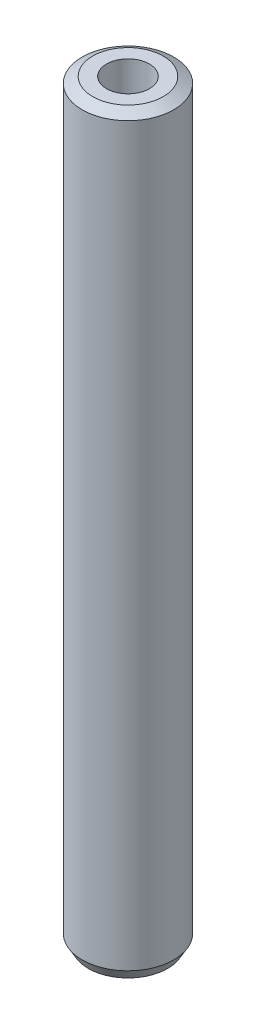
ISO-10303-21;
HEADER;
FILE_DESCRIPTION(('STEP AP214'),'2;1');
FILE_NAME('part.step','',(''),(''),'','','');
FILE_SCHEMA(('AUTOMOTIVE_DESIGN { 1 0 10303 214 1 1 1 1 }'));
ENDSEC;
DATA;
#1=APPLICATION_CONTEXT('core data for automotive mechanical design processes');
#2=APPLICATION_PROTOCOL_DEFINITION('international standard','automotive_design',2000,#1);
#3=PRODUCT_CONTEXT('',#1,'mechanical');
#4=PRODUCT('Part','Part','',(#3));
#5=PRODUCT_RELATED_PRODUCT_CATEGORY('part','',(#4));
#6=PRODUCT_DEFINITION_FORMATION('','',#4);
#7=PRODUCT_DEFINITION_CONTEXT('part definition',#1,'design');
#8=PRODUCT_DEFINITION('design','',#6,#7);
#9=PRODUCT_DEFINITION_SHAPE('','',#8);
#10=(LENGTH_UNIT() NAMED_UNIT(*) SI_UNIT(.MILLI.,.METRE.));
#11=(NAMED_UNIT(*) PLANE_ANGLE_UNIT() SI_UNIT($,.RADIAN.));
#12=(NAMED_UNIT(*) SI_UNIT($,.STERADIAN.) SOLID_ANGLE_UNIT());
#13=UNCERTAINTY_MEASURE_WITH_UNIT(LENGTH_MEASURE(1.E-05),#10,'distance_accuracy_value','');
#14=(GEOMETRIC_REPRESENTATION_CONTEXT(3) GLOBAL_UNCERTAINTY_ASSIGNED_CONTEXT((#13)) GLOBAL_UNIT_ASSIGNED_CONTEXT((#10,
#11,#12)) REPRESENTATION_CONTEXT('',''));
#15=CARTESIAN_POINT('',(0.,0.,0.));
#16=DIRECTION('',(0.,0.,1.));
#17=DIRECTION('',(1.,0.,0.));
#18=AXIS2_PLACEMENT_3D('',#15,#16,#17);
#19=CARTESIAN_POINT('',(0.,164.482726290272,0.));
#20=DIRECTION('',(0.,-1.,0.));
#21=DIRECTION('',(0.,0.,-1.));
#22=AXIS2_PLACEMENT_3D('',#19,#20,#21);
#23=CYLINDRICAL_SURFACE('',#22,10.);
#24=CARTESIAN_POINT('',(0.,163.153602783532,0.));
#25=DIRECTION('',(0.,1.,0.));
#26=DIRECTION('',(0.,0.,1.));
#27=AXIS2_PLACEMENT_3D('',#24,#25,#26);
#28=CIRCLE('',#27,10.);
#29=CARTESIAN_POINT('',(0.,163.153602783532,10.));
#30=VERTEX_POINT('',#29);
#31=EDGE_CURVE('E50',#30,#30,#28,.F.);
#32=ORIENTED_EDGE('',*,*,#31,.T.);
#33=EDGE_LOOP('',(#32));
#34=FACE_BOUND('',#33,.T.);
#35=CARTESIAN_POINT('',(0.,2.30210944320819,0.));
#36=DIRECTION('',(0.,1.,0.));
#37=DIRECTION('',(0.,0.,1.));
#38=AXIS2_PLACEMENT_3D('',#35,#36,#37);
#39=CIRCLE('',#38,10.);
#40=CARTESIAN_POINT('',(0.,2.30210944320819,10.));
#41=VERTEX_POINT('',#40);
#42=EDGE_CURVE('E51',#41,#41,#39,.T.);
#43=ORIENTED_EDGE('',*,*,#42,.T.);
#44=EDGE_LOOP('',(#43));
#45=FACE_BOUND('',#44,.T.);
#46=ADVANCED_FACE('F39',(#34,#45),#23,.T.);
#47=CARTESIAN_POINT('',(0.,164.482726290272,0.));
#48=DIRECTION('',(0.,1.,0.));
#49=DIRECTION('',(0.,0.,1.));
#50=AXIS2_PLACEMENT_3D('',#47,#48,#49);
#51=PLANE('',#50);
#52=CARTESIAN_POINT('',(0.,164.482726290272,0.));
#53=DIRECTION('',(0.,1.,0.));
#54=DIRECTION('',(0.,0.,1.));
#55=AXIS2_PLACEMENT_3D('',#52,#53,#54);
#56=CIRCLE('',#55,7.69789055679179);
#57=CARTESIAN_POINT('',(0.,164.482726290272,7.69789055679179));
#58=VERTEX_POINT('',#57);
#59=EDGE_CURVE('E54',#58,#58,#56,.T.);
#60=ORIENTED_EDGE('',*,*,#59,.T.);
#61=EDGE_LOOP('',(#60));
#62=FACE_BOUND('',#61,.T.);
#63=CARTESIAN_POINT('',(0.,164.482726290272,0.));
#64=DIRECTION('',(0.,1.,0.));
#65=DIRECTION('',(0.,0.,1.));
#66=AXIS2_PLACEMENT_3D('',#63,#64,#65);
#67=CIRCLE('',#66,4.6859806340316);
#68=CARTESIAN_POINT('',(0.,164.482726290272,4.6859806340316));
#69=VERTEX_POINT('',#68);
#70=EDGE_CURVE('E58',#69,#69,#67,.T.);
#71=ORIENTED_EDGE('',*,*,#70,.F.);
#72=EDGE_LOOP('',(#71));
#73=FACE_BOUND('',#72,.T.);
#74=ADVANCED_FACE('F69',(#62,#73),#51,.T.);
#75=CARTESIAN_POINT('',(0.,0.,0.));
#76=DIRECTION('',(0.,1.,0.));
#77=DIRECTION('',(0.,0.,1.));
#78=AXIS2_PLACEMENT_3D('',#75,#76,#77);
#79=PLANE('',#78);
#80=CARTESIAN_POINT('',(0.,0.,0.));
#81=DIRECTION('',(0.,1.,0.));
#82=DIRECTION('',(0.,0.,1.));
#83=AXIS2_PLACEMENT_3D('',#80,#81,#82);
#84=CIRCLE('',#83,8.67087649325976);
#85=CARTESIAN_POINT('',(0.,0.,8.67087649325976));
#86=VERTEX_POINT('',#85);
#87=EDGE_CURVE('E10',#86,#86,#84,.F.);
#88=ORIENTED_EDGE('',*,*,#87,.T.);
#89=EDGE_LOOP('',(#88));
#90=FACE_BOUND('',#89,.T.);
#91=CARTESIAN_POINT('',(0.,0.,0.));
#92=DIRECTION('',(0.,1.,0.));
#93=DIRECTION('',(0.,0.,1.));
#94=AXIS2_PLACEMENT_3D('',#91,#92,#93);
#95=CIRCLE('',#94,4.6859806340316);
#96=CARTESIAN_POINT('',(0.,0.,4.6859806340316));
#97=VERTEX_POINT('',#96);
#98=EDGE_CURVE('E63',#97,#97,#95,.T.);
#99=ORIENTED_EDGE('',*,*,#98,.T.);
#100=EDGE_LOOP('',(#99));
#101=FACE_BOUND('',#100,.T.);
#102=ADVANCED_FACE('F75',(#90,#101),#79,.F.);
#103=CARTESIAN_POINT('',(0.,164.482726290272,0.));
#104=DIRECTION('',(0.,-1.,0.));
#105=DIRECTION('',(0.,0.,-1.));
#106=AXIS2_PLACEMENT_3D('',#103,#104,#105);
#107=CYLINDRICAL_SURFACE('',#106,4.6859806340316);
#108=ORIENTED_EDGE('',*,*,#70,.T.);
#109=EDGE_LOOP('',(#108));
#110=FACE_BOUND('',#109,.T.);
#111=ORIENTED_EDGE('',*,*,#98,.F.);
#112=EDGE_LOOP('',(#111));
#113=FACE_BOUND('',#112,.T.);
#114=ADVANCED_FACE('F70',(#110,#113),#107,.F.);
#115=CARTESIAN_POINT('',(0.,164.482726290272,0.));
#116=DIRECTION('',(0.,-1.,0.));
#117=DIRECTION('',(0.,0.,-1.));
#118=AXIS2_PLACEMENT_3D('',#115,#116,#117);
#119=CONICAL_SURFACE('',#118,7.69789055679179,1.04719755119659);
#120=ORIENTED_EDGE('',*,*,#31,.F.);
#121=EDGE_LOOP('',(#120));
#122=FACE_BOUND('',#121,.T.);
#123=ORIENTED_EDGE('',*,*,#59,.F.);
#124=EDGE_LOOP('',(#123));
#125=FACE_BOUND('',#124,.T.);
#126=ADVANCED_FACE('F81',(#122,#125),#119,.T.);
#127=CARTESIAN_POINT('',(0.,2.30210944320819,0.));
#128=DIRECTION('',(0.,1.,0.));
#129=DIRECTION('',(0.,0.,1.));
#130=AXIS2_PLACEMENT_3D('',#127,#128,#129);
#131=CONICAL_SURFACE('',#130,10.,0.523598775598303);
#132=ORIENTED_EDGE('',*,*,#87,.F.);
#133=EDGE_LOOP('',(#132));
#134=FACE_BOUND('',#133,.T.);
#135=ORIENTED_EDGE('',*,*,#42,.F.);
#136=EDGE_LOOP('',(#135));
#137=FACE_BOUND('',#136,.T.);
#138=ADVANCED_FACE('F45',(#134,#137),#131,.T.);
#139=CLOSED_SHELL('',(#46,#74,#102,#114,#126,#138));
#140=MANIFOLD_SOLID_BREP('B2',#139);
#141=ADVANCED_BREP_SHAPE_REPRESENTATION('',(#18,#140),#14);
#142=SHAPE_DEFINITION_REPRESENTATION(#9,#141);
ENDSEC;
END-ISO-10303-21;
